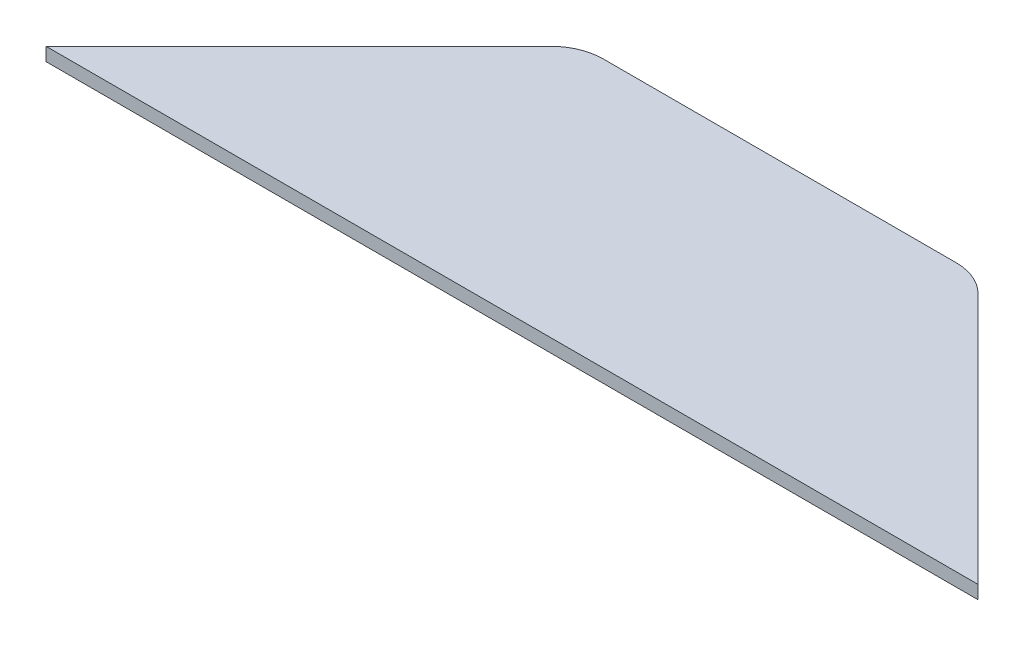
ISO-10303-21;
HEADER;
FILE_DESCRIPTION(('STEP AP214'),'2;1');
FILE_NAME('part.step','',(''),(''),'','','');
FILE_SCHEMA(('AUTOMOTIVE_DESIGN { 1 0 10303 214 1 1 1 1 }'));
ENDSEC;
DATA;
#1=APPLICATION_CONTEXT('core data for automotive mechanical design processes');
#2=APPLICATION_PROTOCOL_DEFINITION('international standard','automotive_design',2000,#1);
#3=PRODUCT_CONTEXT('',#1,'mechanical');
#4=PRODUCT('Part','Part','',(#3));
#5=PRODUCT_RELATED_PRODUCT_CATEGORY('part','',(#4));
#6=PRODUCT_DEFINITION_FORMATION('','',#4);
#7=PRODUCT_DEFINITION_CONTEXT('part definition',#1,'design');
#8=PRODUCT_DEFINITION('design','',#6,#7);
#9=PRODUCT_DEFINITION_SHAPE('','',#8);
#10=(LENGTH_UNIT() NAMED_UNIT(*) SI_UNIT(.MILLI.,.METRE.));
#11=(NAMED_UNIT(*) PLANE_ANGLE_UNIT() SI_UNIT($,.RADIAN.));
#12=(NAMED_UNIT(*) SI_UNIT($,.STERADIAN.) SOLID_ANGLE_UNIT());
#13=UNCERTAINTY_MEASURE_WITH_UNIT(LENGTH_MEASURE(1.E-05),#10,'distance_accuracy_value','');
#14=(GEOMETRIC_REPRESENTATION_CONTEXT(3) GLOBAL_UNCERTAINTY_ASSIGNED_CONTEXT((#13)) GLOBAL_UNIT_ASSIGNED_CONTEXT((#10,
#11,#12)) REPRESENTATION_CONTEXT('',''));
#15=CARTESIAN_POINT('',(0.,0.,0.));
#16=DIRECTION('',(0.,0.,1.));
#17=DIRECTION('',(1.,0.,0.));
#18=AXIS2_PLACEMENT_3D('',#15,#16,#17);
#19=CARTESIAN_POINT('',(-55.9434999999999,1.6002,32.131));
#20=DIRECTION('',(0.,0.,-1.));
#21=DIRECTION('',(-1.,0.,0.));
#22=AXIS2_PLACEMENT_3D('',#19,#20,#21);
#23=PLANE('',#22);
#24=DIRECTION('',(1.,0.,0.));
#25=VECTOR('',#24,1.);
#26=CARTESIAN_POINT('',(-55.9434999999999,0.,32.131));
#27=LINE('',#26,#25);
#28=CARTESIAN_POINT('',(-55.9434999999999,0.,32.131));
#29=VERTEX_POINT('',#28);
#30=CARTESIAN_POINT('',(55.9434999999999,0.,32.131));
#31=VERTEX_POINT('',#30);
#32=EDGE_CURVE('E115',#29,#31,#27,.T.);
#33=ORIENTED_EDGE('',*,*,#32,.T.);
#34=DIRECTION('',(0.,-1.,0.));
#35=VECTOR('',#34,1.);
#36=CARTESIAN_POINT('',(55.9434999999999,1.6002,32.131));
#37=LINE('',#36,#35);
#38=CARTESIAN_POINT('',(55.9434999999999,1.6002,32.131));
#39=VERTEX_POINT('',#38);
#40=EDGE_CURVE('E11',#39,#31,#37,.T.);
#41=ORIENTED_EDGE('',*,*,#40,.F.);
#42=DIRECTION('',(1.,0.,0.));
#43=VECTOR('',#42,1.);
#44=CARTESIAN_POINT('',(-55.9434999999999,1.6002,32.131));
#45=LINE('',#44,#43);
#46=CARTESIAN_POINT('',(-55.9434999999999,1.6002,32.131));
#47=VERTEX_POINT('',#46);
#48=EDGE_CURVE('E125',#47,#39,#45,.T.);
#49=ORIENTED_EDGE('',*,*,#48,.F.);
#50=DIRECTION('',(0.,-1.,0.));
#51=VECTOR('',#50,1.);
#52=CARTESIAN_POINT('',(-55.9434999999999,1.6002,32.131));
#53=LINE('',#52,#51);
#54=EDGE_CURVE('E111',#47,#29,#53,.T.);
#55=ORIENTED_EDGE('',*,*,#54,.T.);
#56=EDGE_LOOP('',(#33,#41,#49,#55));
#57=FACE_BOUND('',#56,.T.);
#58=ADVANCED_FACE('F31',(#57),#23,.F.);
#59=CARTESIAN_POINT('',(25.6723719394654,1.6002,1.85987193946543));
#60=DIRECTION('',(-0.707106781186549,0.,0.707106781186547));
#61=DIRECTION('',(0.707106781186547,0.,0.707106781186549));
#62=AXIS2_PLACEMENT_3D('',#59,#60,#61);
#63=PLANE('',#62);
#64=DIRECTION('',(-0.707106781186547,0.,-0.707106781186548));
#65=VECTOR('',#64,1.);
#66=CARTESIAN_POINT('',(25.6723719394654,0.,1.85987193946543));
#67=LINE('',#66,#65);
#68=CARTESIAN_POINT('',(25.6723719394654,0.,1.85987193946543));
#69=VERTEX_POINT('',#68);
#70=EDGE_CURVE('E118',#31,#69,#67,.T.);
#71=ORIENTED_EDGE('',*,*,#70,.T.);
#72=DIRECTION('',(0.,-1.,0.));
#73=VECTOR('',#72,1.);
#74=CARTESIAN_POINT('',(25.6723719394654,1.6002,1.85987193946543));
#75=LINE('',#74,#73);
#76=CARTESIAN_POINT('',(25.6723719394654,1.6002,1.85987193946543));
#77=VERTEX_POINT('',#76);
#78=EDGE_CURVE('E39',#77,#69,#75,.T.);
#79=ORIENTED_EDGE('',*,*,#78,.F.);
#80=DIRECTION('',(-0.707106781186547,0.,-0.707106781186548));
#81=VECTOR('',#80,1.);
#82=CARTESIAN_POINT('',(25.6723719394654,1.6002,1.85987193946543));
#83=LINE('',#82,#81);
#84=EDGE_CURVE('E84',#39,#77,#83,.T.);
#85=ORIENTED_EDGE('',*,*,#84,.F.);
#86=ORIENTED_EDGE('',*,*,#40,.T.);
#87=EDGE_LOOP('',(#71,#79,#85,#86));
#88=FACE_BOUND('',#87,.T.);
#89=ADVANCED_FACE('F149',(#88),#63,.F.);
#90=CARTESIAN_POINT('',(21.1822438789308,1.6002,6.35));
#91=DIRECTION('',(0.,-1.,0.));
#92=DIRECTION('',(0.,0.,-1.));
#93=AXIS2_PLACEMENT_3D('',#90,#91,#92);
#94=CYLINDRICAL_SURFACE('',#93,6.35);
#95=CARTESIAN_POINT('',(21.1822438789308,0.,6.35));
#96=DIRECTION('',(0.,1.,0.));
#97=DIRECTION('',(0.,0.,1.));
#98=AXIS2_PLACEMENT_3D('',#95,#96,#97);
#99=CIRCLE('',#98,6.35);
#100=CARTESIAN_POINT('',(21.1822438789308,0.,0.));
#101=VERTEX_POINT('',#100);
#102=EDGE_CURVE('E120',#69,#101,#99,.T.);
#103=ORIENTED_EDGE('',*,*,#102,.T.);
#104=DIRECTION('',(0.,-1.,0.));
#105=VECTOR('',#104,1.);
#106=CARTESIAN_POINT('',(21.1822438789308,1.6002,0.));
#107=LINE('',#106,#105);
#108=CARTESIAN_POINT('',(21.1822438789308,1.6002,0.));
#109=VERTEX_POINT('',#108);
#110=EDGE_CURVE('E106',#109,#101,#107,.T.);
#111=ORIENTED_EDGE('',*,*,#110,.F.);
#112=CARTESIAN_POINT('',(21.1822438789308,1.6002,6.35));
#113=DIRECTION('',(0.,1.,0.));
#114=DIRECTION('',(0.,0.,1.));
#115=AXIS2_PLACEMENT_3D('',#112,#113,#114);
#116=CIRCLE('',#115,6.35);
#117=EDGE_CURVE('E97',#77,#109,#116,.T.);
#118=ORIENTED_EDGE('',*,*,#117,.F.);
#119=ORIENTED_EDGE('',*,*,#78,.T.);
#120=EDGE_LOOP('',(#103,#111,#118,#119));
#121=FACE_BOUND('',#120,.T.);
#122=ADVANCED_FACE('F131',(#121),#94,.T.);
#123=CARTESIAN_POINT('',(21.1822438789308,1.6002,0.));
#124=DIRECTION('',(0.,0.,1.));
#125=DIRECTION('',(1.,0.,0.));
#126=AXIS2_PLACEMENT_3D('',#123,#124,#125);
#127=PLANE('',#126);
#128=DIRECTION('',(-1.,0.,0.));
#129=VECTOR('',#128,1.);
#130=CARTESIAN_POINT('',(21.1822438789308,0.,0.));
#131=LINE('',#130,#129);
#132=CARTESIAN_POINT('',(-21.1822438789308,0.,0.));
#133=VERTEX_POINT('',#132);
#134=EDGE_CURVE('E105',#101,#133,#131,.T.);
#135=ORIENTED_EDGE('',*,*,#134,.T.);
#136=DIRECTION('',(0.,-1.,0.));
#137=VECTOR('',#136,1.);
#138=CARTESIAN_POINT('',(-21.1822438789308,1.6002,0.));
#139=LINE('',#138,#137);
#140=CARTESIAN_POINT('',(-21.1822438789308,1.6002,0.));
#141=VERTEX_POINT('',#140);
#142=EDGE_CURVE('E102',#141,#133,#139,.T.);
#143=ORIENTED_EDGE('',*,*,#142,.F.);
#144=DIRECTION('',(-1.,0.,0.));
#145=VECTOR('',#144,1.);
#146=CARTESIAN_POINT('',(21.1822438789308,1.6002,0.));
#147=LINE('',#146,#145);
#148=EDGE_CURVE('E91',#109,#141,#147,.T.);
#149=ORIENTED_EDGE('',*,*,#148,.F.);
#150=ORIENTED_EDGE('',*,*,#110,.T.);
#151=EDGE_LOOP('',(#135,#143,#149,#150));
#152=FACE_BOUND('',#151,.T.);
#153=ADVANCED_FACE('F103',(#152),#127,.F.);
#154=CARTESIAN_POINT('',(-21.1822438789308,1.6002,6.35));
#155=DIRECTION('',(0.,-1.,0.));
#156=DIRECTION('',(0.,0.,-1.));
#157=AXIS2_PLACEMENT_3D('',#154,#155,#156);
#158=CYLINDRICAL_SURFACE('',#157,6.35);
#159=CARTESIAN_POINT('',(-21.1822438789308,0.,6.35));
#160=DIRECTION('',(0.,1.,0.));
#161=DIRECTION('',(0.,0.,1.));
#162=AXIS2_PLACEMENT_3D('',#159,#160,#161);
#163=CIRCLE('',#162,6.35);
#164=CARTESIAN_POINT('',(-25.6723719394654,0.,1.85987193946544));
#165=VERTEX_POINT('',#164);
#166=EDGE_CURVE('E70',#133,#165,#163,.T.);
#167=ORIENTED_EDGE('',*,*,#166,.T.);
#168=DIRECTION('',(0.,-1.,0.));
#169=VECTOR('',#168,1.);
#170=CARTESIAN_POINT('',(-25.6723719394654,1.6002,1.85987193946544));
#171=LINE('',#170,#169);
#172=CARTESIAN_POINT('',(-25.6723719394654,1.6002,1.85987193946544));
#173=VERTEX_POINT('',#172);
#174=EDGE_CURVE('E107',#173,#165,#171,.T.);
#175=ORIENTED_EDGE('',*,*,#174,.F.);
#176=CARTESIAN_POINT('',(-21.1822438789308,1.6002,6.35));
#177=DIRECTION('',(0.,1.,0.));
#178=DIRECTION('',(0.,0.,1.));
#179=AXIS2_PLACEMENT_3D('',#176,#177,#178);
#180=CIRCLE('',#179,6.35);
#181=EDGE_CURVE('E95',#141,#173,#180,.T.);
#182=ORIENTED_EDGE('',*,*,#181,.F.);
#183=ORIENTED_EDGE('',*,*,#142,.T.);
#184=EDGE_LOOP('',(#167,#175,#182,#183));
#185=FACE_BOUND('',#184,.T.);
#186=ADVANCED_FACE('F109',(#185),#158,.T.);
#187=CARTESIAN_POINT('',(-25.6723719394654,1.6002,1.85987193946544));
#188=DIRECTION('',(0.707106781186549,0.,0.707106781186546));
#189=DIRECTION('',(0.707106781186546,0.,-0.707106781186549));
#190=AXIS2_PLACEMENT_3D('',#187,#188,#189);
#191=PLANE('',#190);
#192=DIRECTION('',(-0.707106781186546,0.,0.707106781186549));
#193=VECTOR('',#192,1.);
#194=CARTESIAN_POINT('',(-25.6723719394654,0.,1.85987193946544));
#195=LINE('',#194,#193);
#196=EDGE_CURVE('E76',#165,#29,#195,.T.);
#197=ORIENTED_EDGE('',*,*,#196,.T.);
#198=ORIENTED_EDGE('',*,*,#54,.F.);
#199=DIRECTION('',(-0.707106781186546,0.,0.707106781186549));
#200=VECTOR('',#199,1.);
#201=CARTESIAN_POINT('',(-25.6723719394654,1.6002,1.85987193946544));
#202=LINE('',#201,#200);
#203=EDGE_CURVE('E47',#173,#47,#202,.T.);
#204=ORIENTED_EDGE('',*,*,#203,.F.);
#205=ORIENTED_EDGE('',*,*,#174,.T.);
#206=EDGE_LOOP('',(#197,#198,#204,#205));
#207=FACE_BOUND('',#206,.T.);
#208=ADVANCED_FACE('F138',(#207),#191,.F.);
#209=CARTESIAN_POINT('',(21.1822438789308,1.6002,6.35));
#210=DIRECTION('',(0.,1.,0.));
#211=DIRECTION('',(0.,0.,1.));
#212=AXIS2_PLACEMENT_3D('',#209,#210,#211);
#213=PLANE('',#212);
#214=ORIENTED_EDGE('',*,*,#48,.T.);
#215=ORIENTED_EDGE('',*,*,#84,.T.);
#216=ORIENTED_EDGE('',*,*,#117,.T.);
#217=ORIENTED_EDGE('',*,*,#148,.T.);
#218=ORIENTED_EDGE('',*,*,#181,.T.);
#219=ORIENTED_EDGE('',*,*,#203,.T.);
#220=EDGE_LOOP('',(#214,#215,#216,#217,#218,#219));
#221=FACE_BOUND('',#220,.T.);
#222=ADVANCED_FACE('F93',(#221),#213,.T.);
#223=CARTESIAN_POINT('',(21.1822438789308,0.,6.35));
#224=DIRECTION('',(0.,1.,0.));
#225=DIRECTION('',(0.,0.,1.));
#226=AXIS2_PLACEMENT_3D('',#223,#224,#225);
#227=PLANE('',#226);
#228=ORIENTED_EDGE('',*,*,#32,.F.);
#229=ORIENTED_EDGE('',*,*,#196,.F.);
#230=ORIENTED_EDGE('',*,*,#166,.F.);
#231=ORIENTED_EDGE('',*,*,#134,.F.);
#232=ORIENTED_EDGE('',*,*,#102,.F.);
#233=ORIENTED_EDGE('',*,*,#70,.F.);
#234=EDGE_LOOP('',(#228,#229,#230,#231,#232,#233));
#235=FACE_BOUND('',#234,.T.);
#236=ADVANCED_FACE('F134',(#235),#227,.F.);
#237=CLOSED_SHELL('',(#58,#89,#122,#153,#186,#208,#222,#236));
#238=MANIFOLD_SOLID_BREP('B2',#237);
#239=ADVANCED_BREP_SHAPE_REPRESENTATION('',(#18,#238),#14);
#240=SHAPE_DEFINITION_REPRESENTATION(#9,#239);
ENDSEC;
END-ISO-10303-21;
